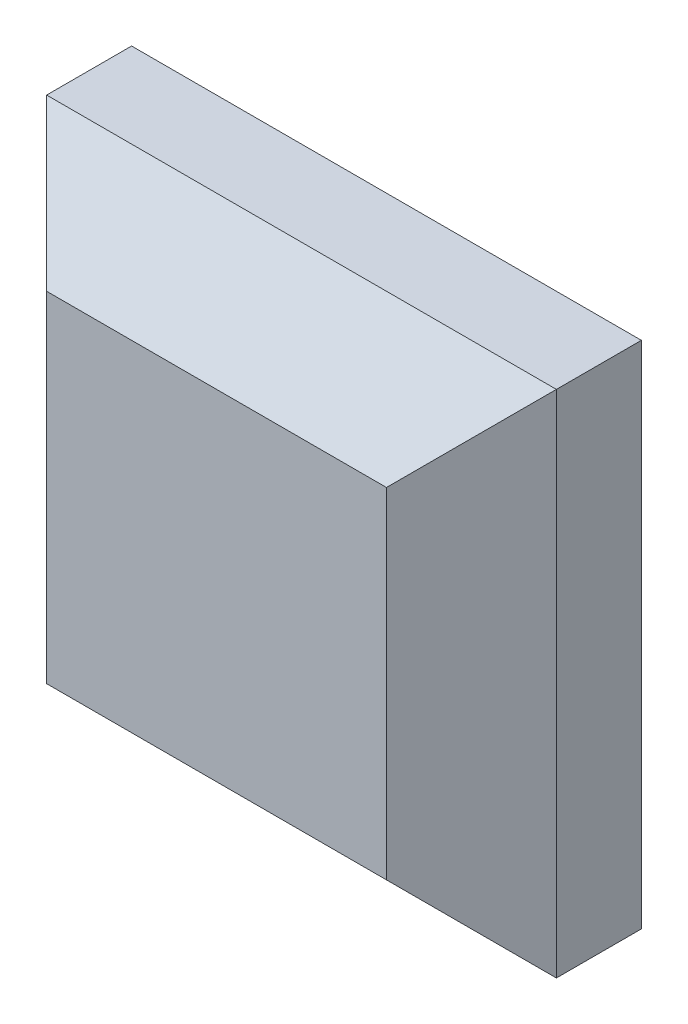
ISO-10303-21;
HEADER;
FILE_DESCRIPTION(('STEP AP214'),'2;1');
FILE_NAME('part.step','',(''),(''),'','','');
FILE_SCHEMA(('AUTOMOTIVE_DESIGN { 1 0 10303 214 1 1 1 1 }'));
ENDSEC;
DATA;
#1=APPLICATION_CONTEXT('core data for automotive mechanical design processes');
#2=APPLICATION_PROTOCOL_DEFINITION('international standard','automotive_design',2000,#1);
#3=PRODUCT_CONTEXT('',#1,'mechanical');
#4=PRODUCT('Part','Part','',(#3));
#5=PRODUCT_RELATED_PRODUCT_CATEGORY('part','',(#4));
#6=PRODUCT_DEFINITION_FORMATION('','',#4);
#7=PRODUCT_DEFINITION_CONTEXT('part definition',#1,'design');
#8=PRODUCT_DEFINITION('design','',#6,#7);
#9=PRODUCT_DEFINITION_SHAPE('','',#8);
#10=(LENGTH_UNIT() NAMED_UNIT(*) SI_UNIT(.MILLI.,.METRE.));
#11=(NAMED_UNIT(*) PLANE_ANGLE_UNIT() SI_UNIT($,.RADIAN.));
#12=(NAMED_UNIT(*) SI_UNIT($,.STERADIAN.) SOLID_ANGLE_UNIT());
#13=UNCERTAINTY_MEASURE_WITH_UNIT(LENGTH_MEASURE(1.E-05),#10,'distance_accuracy_value','');
#14=(GEOMETRIC_REPRESENTATION_CONTEXT(3) GLOBAL_UNCERTAINTY_ASSIGNED_CONTEXT((#13)) GLOBAL_UNIT_ASSIGNED_CONTEXT((#10,
#11,#12)) REPRESENTATION_CONTEXT('',''));
#15=CARTESIAN_POINT('',(0.,0.,0.));
#16=DIRECTION('',(0.,0.,1.));
#17=DIRECTION('',(1.,0.,0.));
#18=AXIS2_PLACEMENT_3D('',#15,#16,#17);
#19=CARTESIAN_POINT('',(13.,-15.,10.));
#20=DIRECTION('',(-1.,0.,0.));
#21=DIRECTION('',(0.,0.,1.));
#22=AXIS2_PLACEMENT_3D('',#19,#20,#21);
#23=PLANE('',#22);
#24=DIRECTION('',(0.,0.,-1.));
#25=VECTOR('',#24,1.);
#26=CARTESIAN_POINT('',(13.,2.5,10.002));
#27=LINE('',#26,#25);
#28=CARTESIAN_POINT('',(13.,2.5,4.1715728752538));
#29=VERTEX_POINT('',#28);
#30=CARTESIAN_POINT('',(13.,2.5,0.));
#31=VERTEX_POINT('',#30);
#32=EDGE_CURVE('E253',#29,#31,#27,.T.);
#33=ORIENTED_EDGE('',*,*,#32,.F.);
#34=DIRECTION('',(0.,1.,0.));
#35=VECTOR('',#34,1.);
#36=CARTESIAN_POINT('',(13.,0.,4.1715728752538));
#37=LINE('',#36,#35);
#38=CARTESIAN_POINT('',(13.,13.,4.1715728752538));
#39=VERTEX_POINT('',#38);
#40=EDGE_CURVE('E268',#39,#29,#37,.F.);
#41=ORIENTED_EDGE('',*,*,#40,.F.);
#42=DIRECTION('',(0.,0.,-1.));
#43=VECTOR('',#42,1.);
#44=CARTESIAN_POINT('',(13.,13.,10.));
#45=LINE('',#44,#43);
#46=CARTESIAN_POINT('',(13.,13.,0.));
#47=VERTEX_POINT('',#46);
#48=EDGE_CURVE('E263',#39,#47,#45,.T.);
#49=ORIENTED_EDGE('',*,*,#48,.T.);
#50=DIRECTION('',(0.,1.,0.));
#51=VECTOR('',#50,1.);
#52=CARTESIAN_POINT('',(13.,0.,0.));
#53=LINE('',#52,#51);
#54=EDGE_CURVE('E305',#31,#47,#53,.T.);
#55=ORIENTED_EDGE('',*,*,#54,.F.);
#56=EDGE_LOOP('',(#33,#41,#49,#55));
#57=FACE_BOUND('',#56,.T.);
#58=ADVANCED_FACE('F41',(#57),#23,.T.);
#59=CARTESIAN_POINT('',(-15.,13.,10.));
#60=DIRECTION('',(0.,-1.,0.));
#61=DIRECTION('',(0.,0.,-1.));
#62=AXIS2_PLACEMENT_3D('',#59,#60,#61);
#63=PLANE('',#62);
#64=DIRECTION('',(0.,0.,-1.));
#65=VECTOR('',#64,1.);
#66=CARTESIAN_POINT('',(2.5,13.,10.002));
#67=LINE('',#66,#65);
#68=CARTESIAN_POINT('',(2.5,13.,4.1715728752538));
#69=VERTEX_POINT('',#68);
#70=CARTESIAN_POINT('',(2.5,13.,0.));
#71=VERTEX_POINT('',#70);
#72=EDGE_CURVE('E254',#69,#71,#67,.T.);
#73=ORIENTED_EDGE('',*,*,#72,.T.);
#74=DIRECTION('',(-1.,0.,0.));
#75=VECTOR('',#74,1.);
#76=CARTESIAN_POINT('',(0.,13.,0.));
#77=LINE('',#76,#75);
#78=EDGE_CURVE('E349',#47,#71,#77,.T.);
#79=ORIENTED_EDGE('',*,*,#78,.F.);
#80=ORIENTED_EDGE('',*,*,#48,.F.);
#81=DIRECTION('',(-1.,0.,0.));
#82=VECTOR('',#81,1.);
#83=CARTESIAN_POINT('',(0.,13.,4.1715728752538));
#84=LINE('',#83,#82);
#85=EDGE_CURVE('E287',#69,#39,#84,.F.);
#86=ORIENTED_EDGE('',*,*,#85,.F.);
#87=EDGE_LOOP('',(#73,#79,#80,#86));
#88=FACE_BOUND('',#87,.T.);
#89=ADVANCED_FACE('F462',(#88),#63,.T.);
#90=CARTESIAN_POINT('',(-13.,-15.,10.));
#91=DIRECTION('',(1.,0.,0.));
#92=DIRECTION('',(0.,0.,-1.));
#93=AXIS2_PLACEMENT_3D('',#90,#91,#92);
#94=PLANE('',#93);
#95=DIRECTION('',(0.,0.,-1.));
#96=VECTOR('',#95,1.);
#97=CARTESIAN_POINT('',(-13.,2.5,10.002));
#98=LINE('',#97,#96);
#99=CARTESIAN_POINT('',(-13.,2.5,4.1715728752538));
#100=VERTEX_POINT('',#99);
#101=CARTESIAN_POINT('',(-13.,2.5,0.));
#102=VERTEX_POINT('',#101);
#103=EDGE_CURVE('E612',#100,#102,#98,.T.);
#104=ORIENTED_EDGE('',*,*,#103,.T.);
#105=DIRECTION('',(0.,-1.,0.));
#106=VECTOR('',#105,1.);
#107=CARTESIAN_POINT('',(-13.,0.,0.));
#108=LINE('',#107,#106);
#109=CARTESIAN_POINT('',(-13.,13.,0.));
#110=VERTEX_POINT('',#109);
#111=EDGE_CURVE('E345',#110,#102,#108,.T.);
#112=ORIENTED_EDGE('',*,*,#111,.F.);
#113=DIRECTION('',(0.,0.,-1.));
#114=VECTOR('',#113,1.);
#115=CARTESIAN_POINT('',(-13.,13.,10.));
#116=LINE('',#115,#114);
#117=CARTESIAN_POINT('',(-13.,13.,4.1715728752538));
#118=VERTEX_POINT('',#117);
#119=EDGE_CURVE('E267',#118,#110,#116,.T.);
#120=ORIENTED_EDGE('',*,*,#119,.F.);
#121=DIRECTION('',(0.,-1.,0.));
#122=VECTOR('',#121,1.);
#123=CARTESIAN_POINT('',(-13.,0.,4.1715728752538));
#124=LINE('',#123,#122);
#125=EDGE_CURVE('E295',#100,#118,#124,.F.);
#126=ORIENTED_EDGE('',*,*,#125,.F.);
#127=EDGE_LOOP('',(#104,#112,#120,#126));
#128=FACE_BOUND('',#127,.T.);
#129=ADVANCED_FACE('F469',(#128),#94,.T.);
#130=CARTESIAN_POINT('',(-15.,-13.,10.));
#131=DIRECTION('',(0.,1.,0.));
#132=DIRECTION('',(0.,0.,1.));
#133=AXIS2_PLACEMENT_3D('',#130,#131,#132);
#134=PLANE('',#133);
#135=DIRECTION('',(0.,0.,-1.));
#136=VECTOR('',#135,1.);
#137=CARTESIAN_POINT('',(-2.5,-13.,10.002));
#138=LINE('',#137,#136);
#139=CARTESIAN_POINT('',(-2.5,-13.,4.1715728752538));
#140=VERTEX_POINT('',#139);
#141=CARTESIAN_POINT('',(-2.5,-13.,0.));
#142=VERTEX_POINT('',#141);
#143=EDGE_CURVE('E602',#140,#142,#138,.T.);
#144=ORIENTED_EDGE('',*,*,#143,.T.);
#145=DIRECTION('',(1.,0.,0.));
#146=VECTOR('',#145,1.);
#147=CARTESIAN_POINT('',(0.,-13.,0.));
#148=LINE('',#147,#146);
#149=CARTESIAN_POINT('',(-13.,-13.,0.));
#150=VERTEX_POINT('',#149);
#151=EDGE_CURVE('E279',#150,#142,#148,.T.);
#152=ORIENTED_EDGE('',*,*,#151,.F.);
#153=DIRECTION('',(0.,0.,-1.));
#154=VECTOR('',#153,1.);
#155=CARTESIAN_POINT('',(-13.,-13.,10.));
#156=LINE('',#155,#154);
#157=CARTESIAN_POINT('',(-13.,-13.,4.1715728752538));
#158=VERTEX_POINT('',#157);
#159=EDGE_CURVE('E278',#158,#150,#156,.T.);
#160=ORIENTED_EDGE('',*,*,#159,.F.);
#161=DIRECTION('',(1.,0.,0.));
#162=VECTOR('',#161,1.);
#163=CARTESIAN_POINT('',(0.,-13.,4.1715728752538));
#164=LINE('',#163,#162);
#165=EDGE_CURVE('E300',#140,#158,#164,.F.);
#166=ORIENTED_EDGE('',*,*,#165,.F.);
#167=EDGE_LOOP('',(#144,#152,#160,#166));
#168=FACE_BOUND('',#167,.T.);
#169=ADVANCED_FACE('F674',(#168),#134,.T.);
#170=CARTESIAN_POINT('',(0.,0.,8.));
#171=DIRECTION('',(0.,0.,-1.));
#172=DIRECTION('',(-1.,0.,0.));
#173=AXIS2_PLACEMENT_3D('',#170,#171,#172);
#174=PLANE('',#173);
#175=DIRECTION('',(-1.,0.,0.));
#176=VECTOR('',#175,1.);
#177=CARTESIAN_POINT('',(2.5,2.5,8.));
#178=LINE('',#177,#176);
#179=CARTESIAN_POINT('',(9.17157287525382,2.5,8.));
#180=VERTEX_POINT('',#179);
#181=CARTESIAN_POINT('',(2.5,2.5,8.));
#182=VERTEX_POINT('',#181);
#183=EDGE_CURVE('E244',#180,#182,#178,.T.);
#184=ORIENTED_EDGE('',*,*,#183,.T.);
#185=DIRECTION('',(0.,1.,0.));
#186=VECTOR('',#185,1.);
#187=CARTESIAN_POINT('',(2.5,13.,8.));
#188=LINE('',#187,#186);
#189=CARTESIAN_POINT('',(2.5,9.17157287525382,8.));
#190=VERTEX_POINT('',#189);
#191=EDGE_CURVE('E231',#182,#190,#188,.T.);
#192=ORIENTED_EDGE('',*,*,#191,.T.);
#193=DIRECTION('',(1.,0.,0.));
#194=VECTOR('',#193,1.);
#195=CARTESIAN_POINT('',(0.,9.17157287525382,8.));
#196=LINE('',#195,#194);
#197=CARTESIAN_POINT('',(9.17157287525382,9.17157287525382,8.));
#198=VERTEX_POINT('',#197);
#199=EDGE_CURVE('E327',#198,#190,#196,.F.);
#200=ORIENTED_EDGE('',*,*,#199,.F.);
#201=DIRECTION('',(0.,-1.,0.));
#202=VECTOR('',#201,1.);
#203=CARTESIAN_POINT('',(9.17157287525382,0.,8.));
#204=LINE('',#203,#202);
#205=EDGE_CURVE('E258',#180,#198,#204,.F.);
#206=ORIENTED_EDGE('',*,*,#205,.F.);
#207=EDGE_LOOP('',(#184,#192,#200,#206));
#208=FACE_BOUND('',#207,.T.);
#209=ADVANCED_FACE('F257',(#208),#174,.T.);
#210=DIRECTION('',(0.,-1.,0.));
#211=VECTOR('',#210,1.);
#212=CARTESIAN_POINT('',(-2.5,13.,8.));
#213=LINE('',#212,#211);
#214=CARTESIAN_POINT('',(-2.5,9.17157287525382,8.));
#215=VERTEX_POINT('',#214);
#216=CARTESIAN_POINT('',(-2.5,2.5,8.));
#217=VERTEX_POINT('',#216);
#218=EDGE_CURVE('E243',#215,#217,#213,.T.);
#219=ORIENTED_EDGE('',*,*,#218,.T.);
#220=DIRECTION('',(-1.,0.,0.));
#221=VECTOR('',#220,1.);
#222=CARTESIAN_POINT('',(-13.,2.5,8.));
#223=LINE('',#222,#221);
#224=CARTESIAN_POINT('',(-9.17157287525382,2.5,8.));
#225=VERTEX_POINT('',#224);
#226=EDGE_CURVE('E535',#217,#225,#223,.T.);
#227=ORIENTED_EDGE('',*,*,#226,.T.);
#228=DIRECTION('',(0.,1.,0.));
#229=VECTOR('',#228,1.);
#230=CARTESIAN_POINT('',(-9.17157287525382,0.,8.));
#231=LINE('',#230,#229);
#232=CARTESIAN_POINT('',(-9.17157287525382,9.17157287525382,8.));
#233=VERTEX_POINT('',#232);
#234=EDGE_CURVE('E312',#233,#225,#231,.F.);
#235=ORIENTED_EDGE('',*,*,#234,.F.);
#236=EDGE_CURVE('E326',#215,#233,#196,.F.);
#237=ORIENTED_EDGE('',*,*,#236,.F.);
#238=EDGE_LOOP('',(#219,#227,#235,#237));
#239=FACE_BOUND('',#238,.T.);
#240=ADVANCED_FACE('F542',(#239),#174,.T.);
#241=DIRECTION('',(1.,0.,0.));
#242=VECTOR('',#241,1.);
#243=CARTESIAN_POINT('',(-13.,-2.5,8.));
#244=LINE('',#243,#242);
#245=CARTESIAN_POINT('',(-9.17157287525382,-2.5,8.));
#246=VERTEX_POINT('',#245);
#247=CARTESIAN_POINT('',(-2.5,-2.5,8.));
#248=VERTEX_POINT('',#247);
#249=EDGE_CURVE('E531',#246,#248,#244,.T.);
#250=ORIENTED_EDGE('',*,*,#249,.T.);
#251=DIRECTION('',(0.,-1.,0.));
#252=VECTOR('',#251,1.);
#253=CARTESIAN_POINT('',(-2.5,-2.5,8.));
#254=LINE('',#253,#252);
#255=CARTESIAN_POINT('',(-2.5,-9.17157287525382,8.));
#256=VERTEX_POINT('',#255);
#257=EDGE_CURVE('E524',#248,#256,#254,.T.);
#258=ORIENTED_EDGE('',*,*,#257,.T.);
#259=DIRECTION('',(-1.,0.,0.));
#260=VECTOR('',#259,1.);
#261=CARTESIAN_POINT('',(0.,-9.17157287525382,8.));
#262=LINE('',#261,#260);
#263=CARTESIAN_POINT('',(-9.17157287525382,-9.17157287525382,8.));
#264=VERTEX_POINT('',#263);
#265=EDGE_CURVE('E318',#264,#256,#262,.F.);
#266=ORIENTED_EDGE('',*,*,#265,.F.);
#267=EDGE_CURVE('E317',#246,#264,#231,.F.);
#268=ORIENTED_EDGE('',*,*,#267,.F.);
#269=EDGE_LOOP('',(#250,#258,#266,#268));
#270=FACE_BOUND('',#269,.T.);
#271=ADVANCED_FACE('F671',(#270),#174,.T.);
#272=CARTESIAN_POINT('',(0.,8.58578643762691,8.58578643762691));
#273=DIRECTION('',(0.,-0.707106781186549,-0.707106781186546));
#274=DIRECTION('',(-1.,0.,0.));
#275=AXIS2_PLACEMENT_3D('',#272,#273,#274);
#276=PLANE('',#275);
#277=ORIENTED_EDGE('',*,*,#199,.T.);
#278=DIRECTION('',(0.,0.707106781186546,-0.707106781186549));
#279=VECTOR('',#278,1.);
#280=CARTESIAN_POINT('',(2.5,10.0847864376269,7.08678643762691));
#281=LINE('',#280,#279);
#282=EDGE_CURVE('E237',#69,#190,#281,.F.);
#283=ORIENTED_EDGE('',*,*,#282,.F.);
#284=ORIENTED_EDGE('',*,*,#85,.T.);
#285=DIRECTION('',(-0.577350269189625,-0.577350269189625,0.577350269189627));
#286=VECTOR('',#285,1.);
#287=CARTESIAN_POINT('',(5.72385762508461,5.72385762508461,11.4477152501692));
#288=LINE('',#287,#286);
#289=EDGE_CURVE('E306',#39,#198,#288,.T.);
#290=ORIENTED_EDGE('',*,*,#289,.T.);
#291=EDGE_LOOP('',(#277,#283,#284,#290));
#292=FACE_BOUND('',#291,.T.);
#293=ADVANCED_FACE('F641',(#292),#276,.T.);
#294=CARTESIAN_POINT('',(-8.58578643762691,0.,8.58578643762691));
#295=DIRECTION('',(0.707106781186549,0.,-0.707106781186546));
#296=DIRECTION('',(0.,-1.,0.));
#297=AXIS2_PLACEMENT_3D('',#294,#295,#296);
#298=PLANE('',#297);
#299=ORIENTED_EDGE('',*,*,#234,.T.);
#300=DIRECTION('',(-0.707106781186546,0.,-0.707106781186549));
#301=VECTOR('',#300,1.);
#302=CARTESIAN_POINT('',(-10.0847864376269,2.5,7.08678643762691));
#303=LINE('',#302,#301);
#304=EDGE_CURVE('E557',#100,#225,#303,.F.);
#305=ORIENTED_EDGE('',*,*,#304,.F.);
#306=ORIENTED_EDGE('',*,*,#125,.T.);
#307=DIRECTION('',(-0.577350269189625,0.577350269189625,-0.577350269189627));
#308=VECTOR('',#307,1.);
#309=CARTESIAN_POINT('',(-5.72385762508461,5.72385762508461,11.4477152501692));
#310=LINE('',#309,#308);
#311=EDGE_CURVE('E301',#233,#118,#310,.T.);
#312=ORIENTED_EDGE('',*,*,#311,.F.);
#313=EDGE_LOOP('',(#299,#305,#306,#312));
#314=FACE_BOUND('',#313,.T.);
#315=ADVANCED_FACE('F647',(#314),#298,.T.);
#316=CARTESIAN_POINT('',(8.58578643762691,0.,8.58578643762691));
#317=DIRECTION('',(-0.707106781186549,0.,-0.707106781186546));
#318=DIRECTION('',(0.,1.,0.));
#319=AXIS2_PLACEMENT_3D('',#316,#317,#318);
#320=PLANE('',#319);
#321=ORIENTED_EDGE('',*,*,#40,.T.);
#322=DIRECTION('',(-0.707106781186546,0.,0.707106781186549));
#323=VECTOR('',#322,1.);
#324=CARTESIAN_POINT('',(4.83478643762692,2.5,12.3367864376269));
#325=LINE('',#324,#323);
#326=EDGE_CURVE('E561',#180,#29,#325,.F.);
#327=ORIENTED_EDGE('',*,*,#326,.F.);
#328=ORIENTED_EDGE('',*,*,#205,.T.);
#329=ORIENTED_EDGE('',*,*,#289,.F.);
#330=EDGE_LOOP('',(#321,#327,#328,#329));
#331=FACE_BOUND('',#330,.T.);
#332=ADVANCED_FACE('F644',(#331),#320,.T.);
#333=CARTESIAN_POINT('',(0.,-8.58578643762691,8.58578643762691));
#334=DIRECTION('',(0.,0.707106781186549,-0.707106781186546));
#335=DIRECTION('',(1.,0.,0.));
#336=AXIS2_PLACEMENT_3D('',#333,#334,#335);
#337=PLANE('',#336);
#338=ORIENTED_EDGE('',*,*,#265,.T.);
#339=DIRECTION('',(0.,-0.707106781186546,-0.707106781186549));
#340=VECTOR('',#339,1.);
#341=CARTESIAN_POINT('',(-2.5,-4.83478643762692,12.3367864376269));
#342=LINE('',#341,#340);
#343=EDGE_CURVE('E571',#140,#256,#342,.F.);
#344=ORIENTED_EDGE('',*,*,#343,.F.);
#345=ORIENTED_EDGE('',*,*,#165,.T.);
#346=DIRECTION('',(-0.577350269189625,-0.577350269189625,-0.577350269189627));
#347=VECTOR('',#346,1.);
#348=CARTESIAN_POINT('',(-5.72385762508461,-5.72385762508461,11.4477152501692));
#349=LINE('',#348,#347);
#350=EDGE_CURVE('E307',#264,#158,#349,.T.);
#351=ORIENTED_EDGE('',*,*,#350,.F.);
#352=EDGE_LOOP('',(#338,#344,#345,#351));
#353=FACE_BOUND('',#352,.T.);
#354=ADVANCED_FACE('F646',(#353),#337,.T.);
#355=CARTESIAN_POINT('',(0.,0.,0.));
#356=DIRECTION('',(0.,0.,-1.));
#357=DIRECTION('',(-1.,0.,0.));
#358=AXIS2_PLACEMENT_3D('',#355,#356,#357);
#359=PLANE('',#358);
#360=CARTESIAN_POINT('',(13.,-13.,0.));
#361=VERTEX_POINT('',#360);
#362=CARTESIAN_POINT('',(13.,-2.5,0.));
#363=VERTEX_POINT('',#362);
#364=EDGE_CURVE('E337',#361,#363,#53,.T.);
#365=ORIENTED_EDGE('',*,*,#364,.T.);
#366=DIRECTION('',(-1.,0.,0.));
#367=VECTOR('',#366,1.);
#368=CARTESIAN_POINT('',(2.5,-2.5,0.));
#369=LINE('',#368,#367);
#370=CARTESIAN_POINT('',(2.5,-2.5,0.));
#371=VERTEX_POINT('',#370);
#372=EDGE_CURVE('E336',#363,#371,#369,.T.);
#373=ORIENTED_EDGE('',*,*,#372,.T.);
#374=DIRECTION('',(0.,-1.,0.));
#375=VECTOR('',#374,1.);
#376=CARTESIAN_POINT('',(2.5,-2.5,0.));
#377=LINE('',#376,#375);
#378=CARTESIAN_POINT('',(2.5,-13.,0.));
#379=VERTEX_POINT('',#378);
#380=EDGE_CURVE('E492',#371,#379,#377,.T.);
#381=ORIENTED_EDGE('',*,*,#380,.T.);
#382=EDGE_CURVE('E344',#379,#361,#148,.T.);
#383=ORIENTED_EDGE('',*,*,#382,.T.);
#384=EDGE_LOOP('',(#365,#373,#381,#383));
#385=FACE_BOUND('',#384,.T.);
#386=ORIENTED_EDGE('',*,*,#78,.T.);
#387=DIRECTION('',(0.,-1.,0.));
#388=VECTOR('',#387,1.);
#389=CARTESIAN_POINT('',(2.5,13.,0.));
#390=LINE('',#389,#388);
#391=CARTESIAN_POINT('',(2.5,2.5,0.));
#392=VERTEX_POINT('',#391);
#393=EDGE_CURVE('E579',#71,#392,#390,.T.);
#394=ORIENTED_EDGE('',*,*,#393,.T.);
#395=DIRECTION('',(1.,0.,0.));
#396=VECTOR('',#395,1.);
#397=CARTESIAN_POINT('',(2.5,2.5,0.));
#398=LINE('',#397,#396);
#399=EDGE_CURVE('E250',#392,#31,#398,.T.);
#400=ORIENTED_EDGE('',*,*,#399,.T.);
#401=ORIENTED_EDGE('',*,*,#54,.T.);
#402=EDGE_LOOP('',(#386,#394,#400,#401));
#403=FACE_BOUND('',#402,.T.);
#404=ORIENTED_EDGE('',*,*,#111,.T.);
#405=DIRECTION('',(1.,0.,0.));
#406=VECTOR('',#405,1.);
#407=CARTESIAN_POINT('',(-13.,2.5,0.));
#408=LINE('',#407,#406);
#409=CARTESIAN_POINT('',(-2.5,2.5,0.));
#410=VERTEX_POINT('',#409);
#411=EDGE_CURVE('E580',#102,#410,#408,.T.);
#412=ORIENTED_EDGE('',*,*,#411,.T.);
#413=DIRECTION('',(0.,1.,0.));
#414=VECTOR('',#413,1.);
#415=CARTESIAN_POINT('',(-2.5,13.,0.));
#416=LINE('',#415,#414);
#417=CARTESIAN_POINT('',(-2.5,13.,0.));
#418=VERTEX_POINT('',#417);
#419=EDGE_CURVE('E576',#410,#418,#416,.T.);
#420=ORIENTED_EDGE('',*,*,#419,.T.);
#421=EDGE_CURVE('E68',#418,#110,#77,.T.);
#422=ORIENTED_EDGE('',*,*,#421,.T.);
#423=EDGE_LOOP('',(#404,#412,#420,#422));
#424=FACE_BOUND('',#423,.T.);
#425=DIRECTION('',(0.,1.,0.));
#426=VECTOR('',#425,1.);
#427=CARTESIAN_POINT('',(15.,-15.,0.));
#428=LINE('',#427,#426);
#429=CARTESIAN_POINT('',(15.,-15.,0.));
#430=VERTEX_POINT('',#429);
#431=CARTESIAN_POINT('',(15.,15.,0.));
#432=VERTEX_POINT('',#431);
#433=EDGE_CURVE('E353',#430,#432,#428,.T.);
#434=ORIENTED_EDGE('',*,*,#433,.F.);
#435=DIRECTION('',(1.,0.,0.));
#436=VECTOR('',#435,1.);
#437=CARTESIAN_POINT('',(-15.,-15.,0.));
#438=LINE('',#437,#436);
#439=CARTESIAN_POINT('',(-15.,-15.,0.));
#440=VERTEX_POINT('',#439);
#441=EDGE_CURVE('E365',#440,#430,#438,.T.);
#442=ORIENTED_EDGE('',*,*,#441,.F.);
#443=DIRECTION('',(0.,-1.,0.));
#444=VECTOR('',#443,1.);
#445=CARTESIAN_POINT('',(-15.,-15.,0.));
#446=LINE('',#445,#444);
#447=CARTESIAN_POINT('',(-15.,15.,0.));
#448=VERTEX_POINT('',#447);
#449=EDGE_CURVE('E361',#448,#440,#446,.T.);
#450=ORIENTED_EDGE('',*,*,#449,.F.);
#451=DIRECTION('',(-1.,0.,0.));
#452=VECTOR('',#451,1.);
#453=CARTESIAN_POINT('',(-15.,15.,0.));
#454=LINE('',#453,#452);
#455=EDGE_CURVE('E357',#432,#448,#454,.T.);
#456=ORIENTED_EDGE('',*,*,#455,.F.);
#457=EDGE_LOOP('',(#434,#442,#450,#456));
#458=FACE_BOUND('',#457,.T.);
#459=ORIENTED_EDGE('',*,*,#151,.T.);
#460=DIRECTION('',(0.,1.,0.));
#461=VECTOR('',#460,1.);
#462=CARTESIAN_POINT('',(-2.5,-2.5,0.));
#463=LINE('',#462,#461);
#464=CARTESIAN_POINT('',(-2.5,-2.5,0.));
#465=VERTEX_POINT('',#464);
#466=EDGE_CURVE('E585',#142,#465,#463,.T.);
#467=ORIENTED_EDGE('',*,*,#466,.T.);
#468=DIRECTION('',(-1.,0.,0.));
#469=VECTOR('',#468,1.);
#470=CARTESIAN_POINT('',(-13.,-2.5,0.));
#471=LINE('',#470,#469);
#472=CARTESIAN_POINT('',(-13.,-2.5,0.));
#473=VERTEX_POINT('',#472);
#474=EDGE_CURVE('E581',#465,#473,#471,.T.);
#475=ORIENTED_EDGE('',*,*,#474,.T.);
#476=EDGE_CURVE('E348',#473,#150,#108,.T.);
#477=ORIENTED_EDGE('',*,*,#476,.T.);
#478=EDGE_LOOP('',(#459,#467,#475,#477));
#479=FACE_BOUND('',#478,.T.);
#480=ADVANCED_FACE('F436',(#385,#403,#424,#458,#479),#359,.T.);
#481=CARTESIAN_POINT('',(15.,-15.,10.));
#482=DIRECTION('',(-1.,0.,0.));
#483=DIRECTION('',(0.,0.,1.));
#484=AXIS2_PLACEMENT_3D('',#481,#482,#483);
#485=PLANE('',#484);
#486=DIRECTION('',(0.,0.,-1.));
#487=VECTOR('',#486,1.);
#488=CARTESIAN_POINT('',(15.,15.,10.));
#489=LINE('',#488,#487);
#490=CARTESIAN_POINT('',(15.,15.,4.99999999999999));
#491=VERTEX_POINT('',#490);
#492=EDGE_CURVE('E378',#491,#432,#489,.T.);
#493=ORIENTED_EDGE('',*,*,#492,.F.);
#494=DIRECTION('',(0.,-1.,0.));
#495=VECTOR('',#494,1.);
#496=CARTESIAN_POINT('',(15.,-15.,4.99999999999999));
#497=LINE('',#496,#495);
#498=CARTESIAN_POINT('',(15.,-15.,4.99999999999999));
#499=VERTEX_POINT('',#498);
#500=EDGE_CURVE('E11',#491,#499,#497,.T.);
#501=ORIENTED_EDGE('',*,*,#500,.T.);
#502=DIRECTION('',(0.,0.,-1.));
#503=VECTOR('',#502,1.);
#504=CARTESIAN_POINT('',(15.,-15.,10.));
#505=LINE('',#504,#503);
#506=EDGE_CURVE('E369',#499,#430,#505,.T.);
#507=ORIENTED_EDGE('',*,*,#506,.T.);
#508=ORIENTED_EDGE('',*,*,#433,.T.);
#509=EDGE_LOOP('',(#493,#501,#507,#508));
#510=FACE_BOUND('',#509,.T.);
#511=ADVANCED_FACE('F431',(#510),#485,.F.);
#512=CARTESIAN_POINT('',(-15.,15.,10.));
#513=DIRECTION('',(0.,-1.,0.));
#514=DIRECTION('',(0.,0.,-1.));
#515=AXIS2_PLACEMENT_3D('',#512,#513,#514);
#516=PLANE('',#515);
#517=DIRECTION('',(0.,0.,-1.));
#518=VECTOR('',#517,1.);
#519=CARTESIAN_POINT('',(-15.,15.,10.));
#520=LINE('',#519,#518);
#521=CARTESIAN_POINT('',(-15.,15.,4.99999999999999));
#522=VERTEX_POINT('',#521);
#523=EDGE_CURVE('E375',#522,#448,#520,.T.);
#524=ORIENTED_EDGE('',*,*,#523,.F.);
#525=DIRECTION('',(1.,0.,0.));
#526=VECTOR('',#525,1.);
#527=CARTESIAN_POINT('',(-15.,15.,4.99999999999999));
#528=LINE('',#527,#526);
#529=EDGE_CURVE('E52',#522,#491,#528,.T.);
#530=ORIENTED_EDGE('',*,*,#529,.T.);
#531=ORIENTED_EDGE('',*,*,#492,.T.);
#532=ORIENTED_EDGE('',*,*,#455,.T.);
#533=EDGE_LOOP('',(#524,#530,#531,#532));
#534=FACE_BOUND('',#533,.T.);
#535=ADVANCED_FACE('F428',(#534),#516,.F.);
#536=CARTESIAN_POINT('',(-15.,-15.,10.));
#537=DIRECTION('',(1.,0.,0.));
#538=DIRECTION('',(0.,0.,-1.));
#539=AXIS2_PLACEMENT_3D('',#536,#537,#538);
#540=PLANE('',#539);
#541=DIRECTION('',(0.,0.,-1.));
#542=VECTOR('',#541,1.);
#543=CARTESIAN_POINT('',(-15.,-15.,10.));
#544=LINE('',#543,#542);
#545=CARTESIAN_POINT('',(-15.,-15.,4.99999999999999));
#546=VERTEX_POINT('',#545);
#547=EDGE_CURVE('E372',#546,#440,#544,.T.);
#548=ORIENTED_EDGE('',*,*,#547,.F.);
#549=DIRECTION('',(0.,1.,0.));
#550=VECTOR('',#549,1.);
#551=CARTESIAN_POINT('',(-15.,-15.,4.99999999999999));
#552=LINE('',#551,#550);
#553=EDGE_CURVE('E398',#546,#522,#552,.T.);
#554=ORIENTED_EDGE('',*,*,#553,.T.);
#555=ORIENTED_EDGE('',*,*,#523,.T.);
#556=ORIENTED_EDGE('',*,*,#449,.T.);
#557=EDGE_LOOP('',(#548,#554,#555,#556));
#558=FACE_BOUND('',#557,.T.);
#559=ADVANCED_FACE('F441',(#558),#540,.F.);
#560=CARTESIAN_POINT('',(-15.,-15.,10.));
#561=DIRECTION('',(0.,1.,0.));
#562=DIRECTION('',(0.,0.,1.));
#563=AXIS2_PLACEMENT_3D('',#560,#561,#562);
#564=PLANE('',#563);
#565=ORIENTED_EDGE('',*,*,#506,.F.);
#566=DIRECTION('',(-1.,0.,0.));
#567=VECTOR('',#566,1.);
#568=CARTESIAN_POINT('',(-15.,-15.,4.99999999999999));
#569=LINE('',#568,#567);
#570=EDGE_CURVE('E394',#499,#546,#569,.T.);
#571=ORIENTED_EDGE('',*,*,#570,.T.);
#572=ORIENTED_EDGE('',*,*,#547,.T.);
#573=ORIENTED_EDGE('',*,*,#441,.T.);
#574=EDGE_LOOP('',(#565,#571,#572,#573));
#575=FACE_BOUND('',#574,.T.);
#576=ADVANCED_FACE('F443',(#575),#564,.F.);
#577=CARTESIAN_POINT('',(0.,0.,10.));
#578=DIRECTION('',(0.,0.,-1.));
#579=DIRECTION('',(-1.,0.,0.));
#580=AXIS2_PLACEMENT_3D('',#577,#578,#579);
#581=PLANE('',#580);
#582=DIRECTION('',(0.,-1.,0.));
#583=VECTOR('',#582,1.);
#584=CARTESIAN_POINT('',(-10.,0.,10.));
#585=LINE('',#584,#583);
#586=CARTESIAN_POINT('',(-10.,10.,10.));
#587=VERTEX_POINT('',#586);
#588=CARTESIAN_POINT('',(-10.,-10.,10.));
#589=VERTEX_POINT('',#588);
#590=EDGE_CURVE('E387',#587,#589,#585,.T.);
#591=ORIENTED_EDGE('',*,*,#590,.T.);
#592=DIRECTION('',(1.,0.,0.));
#593=VECTOR('',#592,1.);
#594=CARTESIAN_POINT('',(0.,-10.,10.));
#595=LINE('',#594,#593);
#596=CARTESIAN_POINT('',(10.,-10.,10.));
#597=VERTEX_POINT('',#596);
#598=EDGE_CURVE('E390',#589,#597,#595,.T.);
#599=ORIENTED_EDGE('',*,*,#598,.T.);
#600=DIRECTION('',(0.,1.,0.));
#601=VECTOR('',#600,1.);
#602=CARTESIAN_POINT('',(10.,0.,10.));
#603=LINE('',#602,#601);
#604=CARTESIAN_POINT('',(10.,10.,10.));
#605=VERTEX_POINT('',#604);
#606=EDGE_CURVE('E381',#597,#605,#603,.T.);
#607=ORIENTED_EDGE('',*,*,#606,.T.);
#608=DIRECTION('',(-1.,0.,0.));
#609=VECTOR('',#608,1.);
#610=CARTESIAN_POINT('',(0.,10.,10.));
#611=LINE('',#610,#609);
#612=EDGE_CURVE('E384',#605,#587,#611,.T.);
#613=ORIENTED_EDGE('',*,*,#612,.T.);
#614=EDGE_LOOP('',(#591,#599,#607,#613));
#615=FACE_BOUND('',#614,.T.);
#616=ADVANCED_FACE('F451',(#615),#581,.F.);
#617=CARTESIAN_POINT('',(0.,10.,10.));
#618=DIRECTION('',(0.,-0.707106781186549,-0.707106781186546));
#619=DIRECTION('',(-1.,0.,0.));
#620=AXIS2_PLACEMENT_3D('',#617,#618,#619);
#621=PLANE('',#620);
#622=DIRECTION('',(-0.577350269189625,-0.577350269189625,0.577350269189627));
#623=VECTOR('',#622,1.);
#624=CARTESIAN_POINT('',(6.66666666666668,6.66666666666668,13.3333333333333));
#625=LINE('',#624,#623);
#626=EDGE_CURVE('E407',#491,#605,#625,.T.);
#627=ORIENTED_EDGE('',*,*,#626,.F.);
#628=ORIENTED_EDGE('',*,*,#529,.F.);
#629=DIRECTION('',(0.577350269189625,-0.577350269189625,0.577350269189627));
#630=VECTOR('',#629,1.);
#631=CARTESIAN_POINT('',(-6.66666666666668,6.66666666666668,13.3333333333333));
#632=LINE('',#631,#630);
#633=EDGE_CURVE('E46',#587,#522,#632,.F.);
#634=ORIENTED_EDGE('',*,*,#633,.F.);
#635=ORIENTED_EDGE('',*,*,#612,.F.);
#636=EDGE_LOOP('',(#627,#628,#634,#635));
#637=FACE_BOUND('',#636,.T.);
#638=ADVANCED_FACE('F44',(#637),#621,.F.);
#639=CARTESIAN_POINT('',(-10.,0.,10.));
#640=DIRECTION('',(0.707106781186549,0.,-0.707106781186546));
#641=DIRECTION('',(0.,-1.,0.));
#642=AXIS2_PLACEMENT_3D('',#639,#640,#641);
#643=PLANE('',#642);
#644=ORIENTED_EDGE('',*,*,#633,.T.);
#645=ORIENTED_EDGE('',*,*,#553,.F.);
#646=DIRECTION('',(0.577350269189625,0.577350269189625,0.577350269189627));
#647=VECTOR('',#646,1.);
#648=CARTESIAN_POINT('',(-6.66666666666668,-6.66666666666668,13.3333333333333));
#649=LINE('',#648,#647);
#650=EDGE_CURVE('E405',#589,#546,#649,.F.);
#651=ORIENTED_EDGE('',*,*,#650,.F.);
#652=ORIENTED_EDGE('',*,*,#590,.F.);
#653=EDGE_LOOP('',(#644,#645,#651,#652));
#654=FACE_BOUND('',#653,.T.);
#655=ADVANCED_FACE('F420',(#654),#643,.F.);
#656=CARTESIAN_POINT('',(10.,0.,10.));
#657=DIRECTION('',(-0.707106781186549,0.,-0.707106781186546));
#658=DIRECTION('',(0.,1.,0.));
#659=AXIS2_PLACEMENT_3D('',#656,#657,#658);
#660=PLANE('',#659);
#661=ORIENTED_EDGE('',*,*,#626,.T.);
#662=ORIENTED_EDGE('',*,*,#606,.F.);
#663=DIRECTION('',(0.577350269189625,-0.577350269189625,-0.577350269189627));
#664=VECTOR('',#663,1.);
#665=CARTESIAN_POINT('',(6.66666666666668,-6.66666666666668,13.3333333333333));
#666=LINE('',#665,#664);
#667=EDGE_CURVE('E272',#499,#597,#666,.F.);
#668=ORIENTED_EDGE('',*,*,#667,.F.);
#669=ORIENTED_EDGE('',*,*,#500,.F.);
#670=EDGE_LOOP('',(#661,#662,#668,#669));
#671=FACE_BOUND('',#670,.T.);
#672=ADVANCED_FACE('F449',(#671),#660,.F.);
#673=CARTESIAN_POINT('',(0.,-10.,10.));
#674=DIRECTION('',(0.,0.707106781186549,-0.707106781186546));
#675=DIRECTION('',(1.,0.,0.));
#676=AXIS2_PLACEMENT_3D('',#673,#674,#675);
#677=PLANE('',#676);
#678=ORIENTED_EDGE('',*,*,#650,.T.);
#679=ORIENTED_EDGE('',*,*,#570,.F.);
#680=ORIENTED_EDGE('',*,*,#667,.T.);
#681=ORIENTED_EDGE('',*,*,#598,.F.);
#682=EDGE_LOOP('',(#678,#679,#680,#681));
#683=FACE_BOUND('',#682,.T.);
#684=ADVANCED_FACE('F447',(#683),#677,.F.);
#685=DIRECTION('',(0.,0.,-1.));
#686=VECTOR('',#685,1.);
#687=CARTESIAN_POINT('',(13.,-2.5,10.002));
#688=LINE('',#687,#686);
#689=CARTESIAN_POINT('',(13.,-2.5,4.1715728752538));
#690=VERTEX_POINT('',#689);
#691=EDGE_CURVE('E487',#690,#363,#688,.T.);
#692=ORIENTED_EDGE('',*,*,#691,.T.);
#693=ORIENTED_EDGE('',*,*,#364,.F.);
#694=DIRECTION('',(0.,0.,-1.));
#695=VECTOR('',#694,1.);
#696=CARTESIAN_POINT('',(13.,-13.,10.));
#697=LINE('',#696,#695);
#698=CARTESIAN_POINT('',(13.,-13.,4.1715728752538));
#699=VERTEX_POINT('',#698);
#700=EDGE_CURVE('E274',#699,#361,#697,.T.);
#701=ORIENTED_EDGE('',*,*,#700,.F.);
#702=EDGE_CURVE('E273',#690,#699,#37,.F.);
#703=ORIENTED_EDGE('',*,*,#702,.F.);
#704=EDGE_LOOP('',(#692,#693,#701,#703));
#705=FACE_BOUND('',#704,.T.);
#706=ADVANCED_FACE('F465',(#705),#23,.T.);
#707=DIRECTION('',(0.,0.,-1.));
#708=VECTOR('',#707,1.);
#709=CARTESIAN_POINT('',(-2.5,13.,10.002));
#710=LINE('',#709,#708);
#711=CARTESIAN_POINT('',(-2.5,13.,4.1715728752538));
#712=VERTEX_POINT('',#711);
#713=EDGE_CURVE('E618',#712,#418,#710,.T.);
#714=ORIENTED_EDGE('',*,*,#713,.F.);
#715=EDGE_CURVE('E283',#118,#712,#84,.F.);
#716=ORIENTED_EDGE('',*,*,#715,.F.);
#717=ORIENTED_EDGE('',*,*,#119,.T.);
#718=ORIENTED_EDGE('',*,*,#421,.F.);
#719=EDGE_LOOP('',(#714,#716,#717,#718));
#720=FACE_BOUND('',#719,.T.);
#721=ADVANCED_FACE('F472',(#720),#63,.T.);
#722=DIRECTION('',(0.,0.,-1.));
#723=VECTOR('',#722,1.);
#724=CARTESIAN_POINT('',(-13.,-2.5,10.002));
#725=LINE('',#724,#723);
#726=CARTESIAN_POINT('',(-13.,-2.5,4.1715728752538));
#727=VERTEX_POINT('',#726);
#728=EDGE_CURVE('E609',#727,#473,#725,.T.);
#729=ORIENTED_EDGE('',*,*,#728,.F.);
#730=EDGE_CURVE('E291',#158,#727,#124,.F.);
#731=ORIENTED_EDGE('',*,*,#730,.F.);
#732=ORIENTED_EDGE('',*,*,#159,.T.);
#733=ORIENTED_EDGE('',*,*,#476,.F.);
#734=EDGE_LOOP('',(#729,#731,#732,#733));
#735=FACE_BOUND('',#734,.T.);
#736=ADVANCED_FACE('F481',(#735),#94,.T.);
#737=DIRECTION('',(0.,0.,-1.));
#738=VECTOR('',#737,1.);
#739=CARTESIAN_POINT('',(2.5,-13.,10.002));
#740=LINE('',#739,#738);
#741=CARTESIAN_POINT('',(2.5,-13.,4.1715728752538));
#742=VERTEX_POINT('',#741);
#743=EDGE_CURVE('E506',#742,#379,#740,.T.);
#744=ORIENTED_EDGE('',*,*,#743,.F.);
#745=EDGE_CURVE('E296',#699,#742,#164,.F.);
#746=ORIENTED_EDGE('',*,*,#745,.F.);
#747=ORIENTED_EDGE('',*,*,#700,.T.);
#748=ORIENTED_EDGE('',*,*,#382,.F.);
#749=EDGE_LOOP('',(#744,#746,#747,#748));
#750=FACE_BOUND('',#749,.T.);
#751=ADVANCED_FACE('F504',(#750),#134,.T.);
#752=DIRECTION('',(0.,1.,0.));
#753=VECTOR('',#752,1.);
#754=CARTESIAN_POINT('',(2.5,-2.5,8.));
#755=LINE('',#754,#753);
#756=CARTESIAN_POINT('',(2.5,-9.17157287525382,8.));
#757=VERTEX_POINT('',#756);
#758=CARTESIAN_POINT('',(2.5,-2.5,8.));
#759=VERTEX_POINT('',#758);
#760=EDGE_CURVE('E60',#757,#759,#755,.T.);
#761=ORIENTED_EDGE('',*,*,#760,.T.);
#762=DIRECTION('',(1.,0.,0.));
#763=VECTOR('',#762,1.);
#764=CARTESIAN_POINT('',(2.5,-2.5,8.));
#765=LINE('',#764,#763);
#766=CARTESIAN_POINT('',(9.17157287525382,-2.5,8.));
#767=VERTEX_POINT('',#766);
#768=EDGE_CURVE('E516',#759,#767,#765,.T.);
#769=ORIENTED_EDGE('',*,*,#768,.T.);
#770=CARTESIAN_POINT('',(9.17157287525382,-9.17157287525382,8.));
#771=VERTEX_POINT('',#770);
#772=EDGE_CURVE('E322',#771,#767,#204,.F.);
#773=ORIENTED_EDGE('',*,*,#772,.F.);
#774=EDGE_CURVE('E316',#757,#771,#262,.F.);
#775=ORIENTED_EDGE('',*,*,#774,.F.);
#776=EDGE_LOOP('',(#761,#769,#773,#775));
#777=FACE_BOUND('',#776,.T.);
#778=ADVANCED_FACE('F515',(#777),#174,.T.);
#779=ORIENTED_EDGE('',*,*,#715,.T.);
#780=DIRECTION('',(0.,-0.707106781186546,0.707106781186549));
#781=VECTOR('',#780,1.);
#782=CARTESIAN_POINT('',(-2.5,10.0847864376269,7.08678643762691));
#783=LINE('',#782,#781);
#784=EDGE_CURVE('E548',#215,#712,#783,.F.);
#785=ORIENTED_EDGE('',*,*,#784,.F.);
#786=ORIENTED_EDGE('',*,*,#236,.T.);
#787=ORIENTED_EDGE('',*,*,#311,.T.);
#788=EDGE_LOOP('',(#779,#785,#786,#787));
#789=FACE_BOUND('',#788,.T.);
#790=ADVANCED_FACE('F553',(#789),#276,.T.);
#791=ORIENTED_EDGE('',*,*,#730,.T.);
#792=DIRECTION('',(0.707106781186546,0.,0.707106781186549));
#793=VECTOR('',#792,1.);
#794=CARTESIAN_POINT('',(-10.0847864376269,-2.5,7.08678643762691));
#795=LINE('',#794,#793);
#796=EDGE_CURVE('E563',#246,#727,#795,.F.);
#797=ORIENTED_EDGE('',*,*,#796,.F.);
#798=ORIENTED_EDGE('',*,*,#267,.T.);
#799=ORIENTED_EDGE('',*,*,#350,.T.);
#800=EDGE_LOOP('',(#791,#797,#798,#799));
#801=FACE_BOUND('',#800,.T.);
#802=ADVANCED_FACE('F656',(#801),#298,.T.);
#803=ORIENTED_EDGE('',*,*,#772,.T.);
#804=DIRECTION('',(0.707106781186546,0.,-0.707106781186549));
#805=VECTOR('',#804,1.);
#806=CARTESIAN_POINT('',(4.83478643762692,-2.5,12.3367864376269));
#807=LINE('',#806,#805);
#808=EDGE_CURVE('E518',#690,#767,#807,.F.);
#809=ORIENTED_EDGE('',*,*,#808,.F.);
#810=ORIENTED_EDGE('',*,*,#702,.T.);
#811=DIRECTION('',(-0.577350269189625,0.577350269189625,0.577350269189627));
#812=VECTOR('',#811,1.);
#813=CARTESIAN_POINT('',(5.72385762508461,-5.72385762508461,11.4477152501692));
#814=LINE('',#813,#812);
#815=EDGE_CURVE('E311',#699,#771,#814,.T.);
#816=ORIENTED_EDGE('',*,*,#815,.T.);
#817=EDGE_LOOP('',(#803,#809,#810,#816));
#818=FACE_BOUND('',#817,.T.);
#819=ADVANCED_FACE('F512',(#818),#320,.T.);
#820=ORIENTED_EDGE('',*,*,#745,.T.);
#821=DIRECTION('',(0.,0.707106781186546,0.707106781186549));
#822=VECTOR('',#821,1.);
#823=CARTESIAN_POINT('',(2.5,-4.83478643762692,12.3367864376269));
#824=LINE('',#823,#822);
#825=EDGE_CURVE('E522',#757,#742,#824,.F.);
#826=ORIENTED_EDGE('',*,*,#825,.F.);
#827=ORIENTED_EDGE('',*,*,#774,.T.);
#828=ORIENTED_EDGE('',*,*,#815,.F.);
#829=EDGE_LOOP('',(#820,#826,#827,#828));
#830=FACE_BOUND('',#829,.T.);
#831=ADVANCED_FACE('F508',(#830),#337,.T.);
#832=CARTESIAN_POINT('',(2.5,2.5,10.002));
#833=DIRECTION('',(0.,1.,0.));
#834=DIRECTION('',(-1.,0.,0.));
#835=AXIS2_PLACEMENT_3D('',#832,#833,#834);
#836=PLANE('',#835);
#837=ORIENTED_EDGE('',*,*,#183,.F.);
#838=ORIENTED_EDGE('',*,*,#326,.T.);
#839=ORIENTED_EDGE('',*,*,#32,.T.);
#840=ORIENTED_EDGE('',*,*,#399,.F.);
#841=DIRECTION('',(0.,0.,-1.));
#842=VECTOR('',#841,1.);
#843=CARTESIAN_POINT('',(2.5,2.5,10.002));
#844=LINE('',#843,#842);
#845=EDGE_CURVE('E234',#182,#392,#844,.T.);
#846=ORIENTED_EDGE('',*,*,#845,.F.);
#847=EDGE_LOOP('',(#837,#838,#839,#840,#846));
#848=FACE_BOUND('',#847,.T.);
#849=ADVANCED_FACE('F247',(#848),#836,.T.);
#850=CARTESIAN_POINT('',(2.5,13.,10.002));
#851=DIRECTION('',(1.,0.,0.));
#852=DIRECTION('',(0.,0.,-1.));
#853=AXIS2_PLACEMENT_3D('',#850,#851,#852);
#854=PLANE('',#853);
#855=ORIENTED_EDGE('',*,*,#191,.F.);
#856=ORIENTED_EDGE('',*,*,#845,.T.);
#857=ORIENTED_EDGE('',*,*,#393,.F.);
#858=ORIENTED_EDGE('',*,*,#72,.F.);
#859=ORIENTED_EDGE('',*,*,#282,.T.);
#860=EDGE_LOOP('',(#855,#856,#857,#858,#859));
#861=FACE_BOUND('',#860,.T.);
#862=ADVANCED_FACE('F233',(#861),#854,.T.);
#863=CARTESIAN_POINT('',(-2.5,13.,10.002));
#864=DIRECTION('',(-1.,0.,0.));
#865=DIRECTION('',(0.,-1.,0.));
#866=AXIS2_PLACEMENT_3D('',#863,#864,#865);
#867=PLANE('',#866);
#868=ORIENTED_EDGE('',*,*,#218,.F.);
#869=ORIENTED_EDGE('',*,*,#784,.T.);
#870=ORIENTED_EDGE('',*,*,#713,.T.);
#871=ORIENTED_EDGE('',*,*,#419,.F.);
#872=DIRECTION('',(0.,0.,-1.));
#873=VECTOR('',#872,1.);
#874=CARTESIAN_POINT('',(-2.5,2.5,10.002));
#875=LINE('',#874,#873);
#876=EDGE_CURVE('E551',#217,#410,#875,.T.);
#877=ORIENTED_EDGE('',*,*,#876,.F.);
#878=EDGE_LOOP('',(#868,#869,#870,#871,#877));
#879=FACE_BOUND('',#878,.T.);
#880=ADVANCED_FACE('F547',(#879),#867,.T.);
#881=CARTESIAN_POINT('',(-13.,2.5,10.002));
#882=DIRECTION('',(0.,1.,0.));
#883=DIRECTION('',(-1.,0.,0.));
#884=AXIS2_PLACEMENT_3D('',#881,#882,#883);
#885=PLANE('',#884);
#886=ORIENTED_EDGE('',*,*,#226,.F.);
#887=ORIENTED_EDGE('',*,*,#876,.T.);
#888=ORIENTED_EDGE('',*,*,#411,.F.);
#889=ORIENTED_EDGE('',*,*,#103,.F.);
#890=ORIENTED_EDGE('',*,*,#304,.T.);
#891=EDGE_LOOP('',(#886,#887,#888,#889,#890));
#892=FACE_BOUND('',#891,.T.);
#893=ADVANCED_FACE('F690',(#892),#885,.T.);
#894=CARTESIAN_POINT('',(-13.,-2.5,10.002));
#895=DIRECTION('',(0.,-1.,0.));
#896=DIRECTION('',(1.,0.,0.));
#897=AXIS2_PLACEMENT_3D('',#894,#895,#896);
#898=PLANE('',#897);
#899=ORIENTED_EDGE('',*,*,#249,.F.);
#900=ORIENTED_EDGE('',*,*,#796,.T.);
#901=ORIENTED_EDGE('',*,*,#728,.T.);
#902=ORIENTED_EDGE('',*,*,#474,.F.);
#903=DIRECTION('',(0.,0.,-1.));
#904=VECTOR('',#903,1.);
#905=CARTESIAN_POINT('',(-2.5,-2.5,10.002));
#906=LINE('',#905,#904);
#907=EDGE_CURVE('E606',#248,#465,#906,.T.);
#908=ORIENTED_EDGE('',*,*,#907,.F.);
#909=EDGE_LOOP('',(#899,#900,#901,#902,#908));
#910=FACE_BOUND('',#909,.T.);
#911=ADVANCED_FACE('F692',(#910),#898,.T.);
#912=CARTESIAN_POINT('',(-2.5,-2.5,10.002));
#913=DIRECTION('',(-1.,0.,0.));
#914=DIRECTION('',(0.,-1.,0.));
#915=AXIS2_PLACEMENT_3D('',#912,#913,#914);
#916=PLANE('',#915);
#917=ORIENTED_EDGE('',*,*,#257,.F.);
#918=ORIENTED_EDGE('',*,*,#907,.T.);
#919=ORIENTED_EDGE('',*,*,#466,.F.);
#920=ORIENTED_EDGE('',*,*,#143,.F.);
#921=ORIENTED_EDGE('',*,*,#343,.T.);
#922=EDGE_LOOP('',(#917,#918,#919,#920,#921));
#923=FACE_BOUND('',#922,.T.);
#924=ADVANCED_FACE('F698',(#923),#916,.T.);
#925=CARTESIAN_POINT('',(2.5,-2.5,10.002));
#926=DIRECTION('',(1.,0.,0.));
#927=DIRECTION('',(0.,1.,0.));
#928=AXIS2_PLACEMENT_3D('',#925,#926,#927);
#929=PLANE('',#928);
#930=ORIENTED_EDGE('',*,*,#760,.F.);
#931=ORIENTED_EDGE('',*,*,#825,.T.);
#932=ORIENTED_EDGE('',*,*,#743,.T.);
#933=ORIENTED_EDGE('',*,*,#380,.F.);
#934=DIRECTION('',(0.,0.,-1.));
#935=VECTOR('',#934,1.);
#936=CARTESIAN_POINT('',(2.5,-2.5,10.002));
#937=LINE('',#936,#935);
#938=EDGE_CURVE('E570',#759,#371,#937,.T.);
#939=ORIENTED_EDGE('',*,*,#938,.F.);
#940=EDGE_LOOP('',(#930,#931,#932,#933,#939));
#941=FACE_BOUND('',#940,.T.);
#942=ADVANCED_FACE('F706',(#941),#929,.T.);
#943=CARTESIAN_POINT('',(2.5,-2.5,10.002));
#944=DIRECTION('',(0.,-1.,0.));
#945=DIRECTION('',(1.,0.,0.));
#946=AXIS2_PLACEMENT_3D('',#943,#944,#945);
#947=PLANE('',#946);
#948=ORIENTED_EDGE('',*,*,#768,.F.);
#949=ORIENTED_EDGE('',*,*,#938,.T.);
#950=ORIENTED_EDGE('',*,*,#372,.F.);
#951=ORIENTED_EDGE('',*,*,#691,.F.);
#952=ORIENTED_EDGE('',*,*,#808,.T.);
#953=EDGE_LOOP('',(#948,#949,#950,#951,#952));
#954=FACE_BOUND('',#953,.T.);
#955=ADVANCED_FACE('F662',(#954),#947,.T.);
#956=CLOSED_SHELL('',(#58,#89,#129,#169,#209,#240,#271,#293,#315,#332,#354,#480,#511,#535,#559,
#576,#616,#638,#655,#672,#684,#706,#721,#736,#751,#778,#790,#802,#819,#831,#849,#862,#880,#893,
#911,#924,#942,#955));
#957=MANIFOLD_SOLID_BREP('B2',#956);
#958=ADVANCED_BREP_SHAPE_REPRESENTATION('',(#18,#957),#14);
#959=SHAPE_DEFINITION_REPRESENTATION(#9,#958);
ENDSEC;
END-ISO-10303-21;
